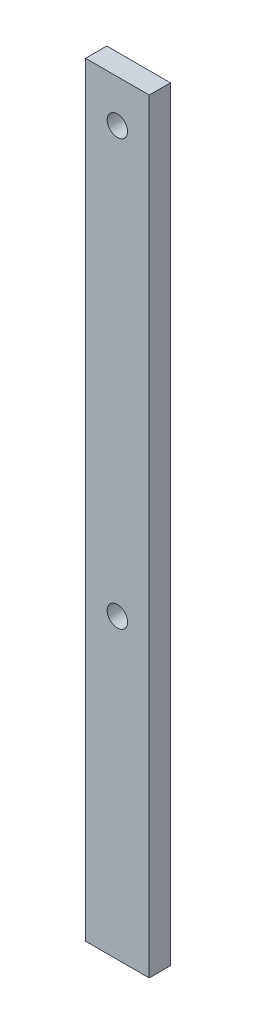
ISO-10303-21;
HEADER;
FILE_DESCRIPTION(('STEP AP214'),'2;1');
FILE_NAME('part.step','',(''),(''),'','','');
FILE_SCHEMA(('AUTOMOTIVE_DESIGN { 1 0 10303 214 1 1 1 1 }'));
ENDSEC;
DATA;
#1=APPLICATION_CONTEXT('core data for automotive mechanical design processes');
#2=APPLICATION_PROTOCOL_DEFINITION('international standard','automotive_design',2000,#1);
#3=PRODUCT_CONTEXT('',#1,'mechanical');
#4=PRODUCT('Part','Part','',(#3));
#5=PRODUCT_RELATED_PRODUCT_CATEGORY('part','',(#4));
#6=PRODUCT_DEFINITION_FORMATION('','',#4);
#7=PRODUCT_DEFINITION_CONTEXT('part definition',#1,'design');
#8=PRODUCT_DEFINITION('design','',#6,#7);
#9=PRODUCT_DEFINITION_SHAPE('','',#8);
#10=(LENGTH_UNIT() NAMED_UNIT(*) SI_UNIT(.MILLI.,.METRE.));
#11=(NAMED_UNIT(*) PLANE_ANGLE_UNIT() SI_UNIT($,.RADIAN.));
#12=(NAMED_UNIT(*) SI_UNIT($,.STERADIAN.) SOLID_ANGLE_UNIT());
#13=UNCERTAINTY_MEASURE_WITH_UNIT(LENGTH_MEASURE(1.E-05),#10,'distance_accuracy_value','');
#14=(GEOMETRIC_REPRESENTATION_CONTEXT(3) GLOBAL_UNCERTAINTY_ASSIGNED_CONTEXT((#13)) GLOBAL_UNIT_ASSIGNED_CONTEXT((#10,
#11,#12)) REPRESENTATION_CONTEXT('',''));
#15=CARTESIAN_POINT('',(0.,0.,0.));
#16=DIRECTION('',(0.,0.,1.));
#17=DIRECTION('',(1.,0.,0.));
#18=AXIS2_PLACEMENT_3D('',#15,#16,#17);
#19=CARTESIAN_POINT('',(0.,0.,6.35));
#20=DIRECTION('',(1.,0.,0.));
#21=DIRECTION('',(0.,0.,-1.));
#22=AXIS2_PLACEMENT_3D('',#19,#20,#21);
#23=PLANE('',#22);
#24=DIRECTION('',(0.,-1.,0.));
#25=VECTOR('',#24,1.);
#26=CARTESIAN_POINT('',(0.,0.,0.));
#27=LINE('',#26,#25);
#28=CARTESIAN_POINT('',(0.,228.6,0.));
#29=VERTEX_POINT('',#28);
#30=CARTESIAN_POINT('',(0.,0.,0.));
#31=VERTEX_POINT('',#30);
#32=EDGE_CURVE('E100',#29,#31,#27,.T.);
#33=ORIENTED_EDGE('',*,*,#32,.T.);
#34=DIRECTION('',(0.,0.,-1.));
#35=VECTOR('',#34,1.);
#36=CARTESIAN_POINT('',(0.,0.,6.35));
#37=LINE('',#36,#35);
#38=CARTESIAN_POINT('',(0.,0.,6.35));
#39=VERTEX_POINT('',#38);
#40=EDGE_CURVE('E11',#39,#31,#37,.T.);
#41=ORIENTED_EDGE('',*,*,#40,.F.);
#42=DIRECTION('',(0.,-1.,0.));
#43=VECTOR('',#42,1.);
#44=CARTESIAN_POINT('',(0.,0.,6.35));
#45=LINE('',#44,#43);
#46=CARTESIAN_POINT('',(0.,228.6,6.35));
#47=VERTEX_POINT('',#46);
#48=EDGE_CURVE('E88',#47,#39,#45,.T.);
#49=ORIENTED_EDGE('',*,*,#48,.F.);
#50=DIRECTION('',(0.,0.,-1.));
#51=VECTOR('',#50,1.);
#52=CARTESIAN_POINT('',(0.,228.6,6.35));
#53=LINE('',#52,#51);
#54=EDGE_CURVE('E96',#47,#29,#53,.T.);
#55=ORIENTED_EDGE('',*,*,#54,.T.);
#56=EDGE_LOOP('',(#33,#41,#49,#55));
#57=FACE_BOUND('',#56,.T.);
#58=ADVANCED_FACE('F37',(#57),#23,.F.);
#59=CARTESIAN_POINT('',(0.,0.,6.35));
#60=DIRECTION('',(0.,1.,0.));
#61=DIRECTION('',(0.,0.,1.));
#62=AXIS2_PLACEMENT_3D('',#59,#60,#61);
#63=PLANE('',#62);
#64=DIRECTION('',(1.,0.,0.));
#65=VECTOR('',#64,1.);
#66=CARTESIAN_POINT('',(0.,0.,0.));
#67=LINE('',#66,#65);
#68=CARTESIAN_POINT('',(19.05,0.,0.));
#69=VERTEX_POINT('',#68);
#70=EDGE_CURVE('E92',#31,#69,#67,.T.);
#71=ORIENTED_EDGE('',*,*,#70,.T.);
#72=DIRECTION('',(0.,0.,-1.));
#73=VECTOR('',#72,1.);
#74=CARTESIAN_POINT('',(19.05,0.,6.35));
#75=LINE('',#74,#73);
#76=CARTESIAN_POINT('',(19.05,0.,6.35));
#77=VERTEX_POINT('',#76);
#78=EDGE_CURVE('E45',#77,#69,#75,.T.);
#79=ORIENTED_EDGE('',*,*,#78,.F.);
#80=DIRECTION('',(1.,0.,0.));
#81=VECTOR('',#80,1.);
#82=CARTESIAN_POINT('',(0.,0.,6.35));
#83=LINE('',#82,#81);
#84=EDGE_CURVE('E83',#39,#77,#83,.T.);
#85=ORIENTED_EDGE('',*,*,#84,.F.);
#86=ORIENTED_EDGE('',*,*,#40,.T.);
#87=EDGE_LOOP('',(#71,#79,#85,#86));
#88=FACE_BOUND('',#87,.T.);
#89=ADVANCED_FACE('F91',(#88),#63,.F.);
#90=CARTESIAN_POINT('',(19.05,0.,6.35));
#91=DIRECTION('',(-1.,0.,0.));
#92=DIRECTION('',(0.,-1.,0.));
#93=AXIS2_PLACEMENT_3D('',#90,#91,#92);
#94=PLANE('',#93);
#95=DIRECTION('',(0.,1.,0.));
#96=VECTOR('',#95,1.);
#97=CARTESIAN_POINT('',(19.05,0.,0.));
#98=LINE('',#97,#96);
#99=CARTESIAN_POINT('',(19.05,228.6,0.));
#100=VERTEX_POINT('',#99);
#101=EDGE_CURVE('E70',#69,#100,#98,.T.);
#102=ORIENTED_EDGE('',*,*,#101,.T.);
#103=DIRECTION('',(0.,0.,-1.));
#104=VECTOR('',#103,1.);
#105=CARTESIAN_POINT('',(19.05,228.6,6.35));
#106=LINE('',#105,#104);
#107=CARTESIAN_POINT('',(19.05,228.6,6.35));
#108=VERTEX_POINT('',#107);
#109=EDGE_CURVE('E93',#108,#100,#106,.T.);
#110=ORIENTED_EDGE('',*,*,#109,.F.);
#111=DIRECTION('',(0.,1.,0.));
#112=VECTOR('',#111,1.);
#113=CARTESIAN_POINT('',(19.05,0.,6.35));
#114=LINE('',#113,#112);
#115=EDGE_CURVE('E86',#77,#108,#114,.T.);
#116=ORIENTED_EDGE('',*,*,#115,.F.);
#117=ORIENTED_EDGE('',*,*,#78,.T.);
#118=EDGE_LOOP('',(#102,#110,#116,#117));
#119=FACE_BOUND('',#118,.T.);
#120=ADVANCED_FACE('F94',(#119),#94,.F.);
#121=CARTESIAN_POINT('',(0.,228.6,6.35));
#122=DIRECTION('',(0.,-1.,0.));
#123=DIRECTION('',(0.,0.,-1.));
#124=AXIS2_PLACEMENT_3D('',#121,#122,#123);
#125=PLANE('',#124);
#126=DIRECTION('',(-1.,0.,0.));
#127=VECTOR('',#126,1.);
#128=CARTESIAN_POINT('',(0.,228.6,0.));
#129=LINE('',#128,#127);
#130=EDGE_CURVE('E76',#100,#29,#129,.T.);
#131=ORIENTED_EDGE('',*,*,#130,.T.);
#132=ORIENTED_EDGE('',*,*,#54,.F.);
#133=DIRECTION('',(-1.,0.,0.));
#134=VECTOR('',#133,1.);
#135=CARTESIAN_POINT('',(0.,228.6,6.35));
#136=LINE('',#135,#134);
#137=EDGE_CURVE('E53',#108,#47,#136,.T.);
#138=ORIENTED_EDGE('',*,*,#137,.F.);
#139=ORIENTED_EDGE('',*,*,#109,.T.);
#140=EDGE_LOOP('',(#131,#132,#138,#139));
#141=FACE_BOUND('',#140,.T.);
#142=ADVANCED_FACE('F108',(#141),#125,.F.);
#143=CARTESIAN_POINT('',(0.,0.,6.35));
#144=DIRECTION('',(0.,0.,-1.));
#145=DIRECTION('',(-1.,0.,0.));
#146=AXIS2_PLACEMENT_3D('',#143,#144,#145);
#147=PLANE('',#146);
#148=CARTESIAN_POINT('',(9.525,215.9,6.35));
#149=DIRECTION('',(0.,0.,1.));
#150=DIRECTION('',(1.,0.,0.));
#151=AXIS2_PLACEMENT_3D('',#148,#149,#150);
#152=CIRCLE('',#151,3.048);
#153=CARTESIAN_POINT('',(12.573,215.9,6.35));
#154=VERTEX_POINT('',#153);
#155=EDGE_CURVE('E120',#154,#154,#152,.T.);
#156=ORIENTED_EDGE('',*,*,#155,.F.);
#157=EDGE_LOOP('',(#156));
#158=FACE_BOUND('',#157,.T.);
#159=CARTESIAN_POINT('',(9.525,88.9,6.35));
#160=DIRECTION('',(0.,0.,1.));
#161=DIRECTION('',(1.,0.,0.));
#162=AXIS2_PLACEMENT_3D('',#159,#160,#161);
#163=CIRCLE('',#162,3.048);
#164=CARTESIAN_POINT('',(12.573,88.9,6.35));
#165=VERTEX_POINT('',#164);
#166=EDGE_CURVE('E114',#165,#165,#163,.T.);
#167=ORIENTED_EDGE('',*,*,#166,.F.);
#168=EDGE_LOOP('',(#167));
#169=FACE_BOUND('',#168,.T.);
#170=ORIENTED_EDGE('',*,*,#48,.T.);
#171=ORIENTED_EDGE('',*,*,#84,.T.);
#172=ORIENTED_EDGE('',*,*,#115,.T.);
#173=ORIENTED_EDGE('',*,*,#137,.T.);
#174=EDGE_LOOP('',(#170,#171,#172,#173));
#175=FACE_BOUND('',#174,.T.);
#176=ADVANCED_FACE('F84',(#158,#169,#175),#147,.F.);
#177=CARTESIAN_POINT('',(0.,0.,0.));
#178=DIRECTION('',(0.,0.,-1.));
#179=DIRECTION('',(-1.,0.,0.));
#180=AXIS2_PLACEMENT_3D('',#177,#178,#179);
#181=PLANE('',#180);
#182=CARTESIAN_POINT('',(9.525,215.9,0.));
#183=DIRECTION('',(0.,0.,1.));
#184=DIRECTION('',(1.,0.,0.));
#185=AXIS2_PLACEMENT_3D('',#182,#183,#184);
#186=CIRCLE('',#185,3.048);
#187=CARTESIAN_POINT('',(12.573,215.9,0.));
#188=VERTEX_POINT('',#187);
#189=EDGE_CURVE('E103',#188,#188,#186,.T.);
#190=ORIENTED_EDGE('',*,*,#189,.T.);
#191=EDGE_LOOP('',(#190));
#192=FACE_BOUND('',#191,.T.);
#193=CARTESIAN_POINT('',(9.525,88.9,0.));
#194=DIRECTION('',(0.,0.,1.));
#195=DIRECTION('',(1.,0.,0.));
#196=AXIS2_PLACEMENT_3D('',#193,#194,#195);
#197=CIRCLE('',#196,3.048);
#198=CARTESIAN_POINT('',(12.573,88.9,0.));
#199=VERTEX_POINT('',#198);
#200=EDGE_CURVE('E117',#199,#199,#197,.T.);
#201=ORIENTED_EDGE('',*,*,#200,.T.);
#202=EDGE_LOOP('',(#201));
#203=FACE_BOUND('',#202,.T.);
#204=ORIENTED_EDGE('',*,*,#32,.F.);
#205=ORIENTED_EDGE('',*,*,#130,.F.);
#206=ORIENTED_EDGE('',*,*,#101,.F.);
#207=ORIENTED_EDGE('',*,*,#70,.F.);
#208=EDGE_LOOP('',(#204,#205,#206,#207));
#209=FACE_BOUND('',#208,.T.);
#210=ADVANCED_FACE('F111',(#192,#203,#209),#181,.T.);
#211=CARTESIAN_POINT('',(9.525,88.9,0.));
#212=DIRECTION('',(0.,0.,1.));
#213=DIRECTION('',(1.,0.,0.));
#214=AXIS2_PLACEMENT_3D('',#211,#212,#213);
#215=CYLINDRICAL_SURFACE('',#214,3.048);
#216=ORIENTED_EDGE('',*,*,#200,.F.);
#217=EDGE_LOOP('',(#216));
#218=FACE_BOUND('',#217,.T.);
#219=ORIENTED_EDGE('',*,*,#166,.T.);
#220=EDGE_LOOP('',(#219));
#221=FACE_BOUND('',#220,.T.);
#222=ADVANCED_FACE('F131',(#218,#221),#215,.F.);
#223=CARTESIAN_POINT('',(9.525,215.9,0.));
#224=DIRECTION('',(0.,0.,1.));
#225=DIRECTION('',(1.,0.,0.));
#226=AXIS2_PLACEMENT_3D('',#223,#224,#225);
#227=CYLINDRICAL_SURFACE('',#226,3.048);
#228=ORIENTED_EDGE('',*,*,#189,.F.);
#229=EDGE_LOOP('',(#228));
#230=FACE_BOUND('',#229,.T.);
#231=ORIENTED_EDGE('',*,*,#155,.T.);
#232=EDGE_LOOP('',(#231));
#233=FACE_BOUND('',#232,.T.);
#234=ADVANCED_FACE('F128',(#230,#233),#227,.F.);
#235=CLOSED_SHELL('',(#58,#89,#120,#142,#176,#210,#222,#234));
#236=MANIFOLD_SOLID_BREP('B2',#235);
#237=ADVANCED_BREP_SHAPE_REPRESENTATION('',(#18,#236),#14);
#238=SHAPE_DEFINITION_REPRESENTATION(#9,#237);
ENDSEC;
END-ISO-10303-21;
